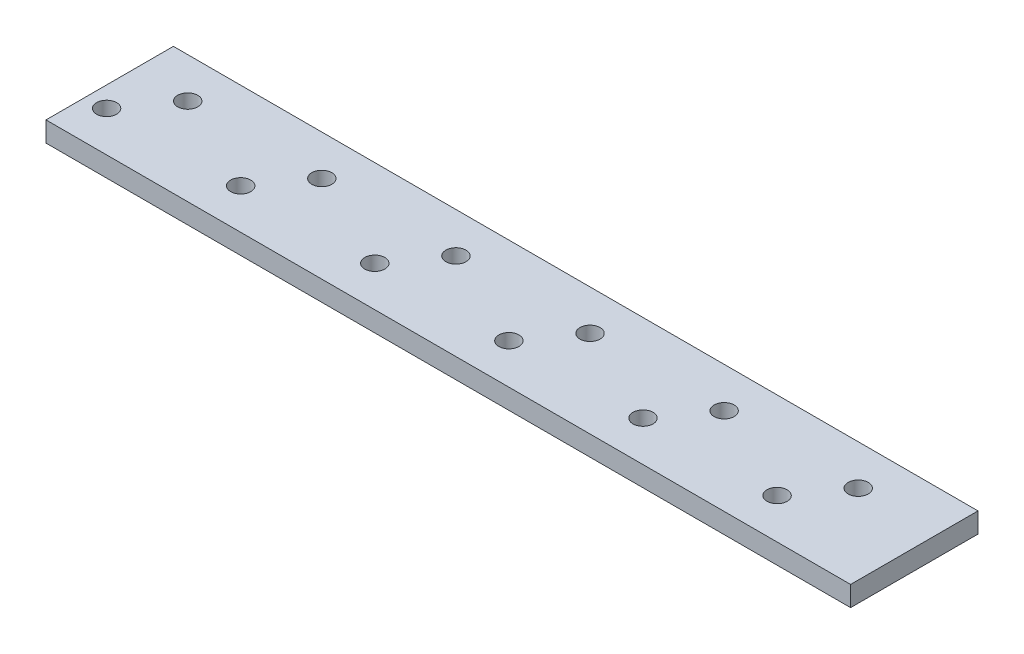
ISO-10303-21;
HEADER;
FILE_DESCRIPTION(('STEP AP214'),'2;1');
FILE_NAME('part.step','',(''),(''),'','','');
FILE_SCHEMA(('AUTOMOTIVE_DESIGN { 1 0 10303 214 1 1 1 1 }'));
ENDSEC;
DATA;
#1=APPLICATION_CONTEXT('core data for automotive mechanical design processes');
#2=APPLICATION_PROTOCOL_DEFINITION('international standard','automotive_design',2000,#1);
#3=PRODUCT_CONTEXT('',#1,'mechanical');
#4=PRODUCT('Part','Part','',(#3));
#5=PRODUCT_RELATED_PRODUCT_CATEGORY('part','',(#4));
#6=PRODUCT_DEFINITION_FORMATION('','',#4);
#7=PRODUCT_DEFINITION_CONTEXT('part definition',#1,'design');
#8=PRODUCT_DEFINITION('design','',#6,#7);
#9=PRODUCT_DEFINITION_SHAPE('','',#8);
#10=(LENGTH_UNIT() NAMED_UNIT(*) SI_UNIT(.MILLI.,.METRE.));
#11=(NAMED_UNIT(*) PLANE_ANGLE_UNIT() SI_UNIT($,.RADIAN.));
#12=(NAMED_UNIT(*) SI_UNIT($,.STERADIAN.) SOLID_ANGLE_UNIT());
#13=UNCERTAINTY_MEASURE_WITH_UNIT(LENGTH_MEASURE(1.E-05),#10,'distance_accuracy_value','');
#14=(GEOMETRIC_REPRESENTATION_CONTEXT(3) GLOBAL_UNCERTAINTY_ASSIGNED_CONTEXT((#13)) GLOBAL_UNIT_ASSIGNED_CONTEXT((#10,
#11,#12)) REPRESENTATION_CONTEXT('',''));
#15=CARTESIAN_POINT('',(0.,0.,0.));
#16=DIRECTION('',(0.,0.,1.));
#17=DIRECTION('',(1.,0.,0.));
#18=AXIS2_PLACEMENT_3D('',#15,#16,#17);
#19=CARTESIAN_POINT('',(60.,3.,9.49999999999999));
#20=DIRECTION('',(-1.,0.,0.));
#21=DIRECTION('',(0.,0.,1.));
#22=AXIS2_PLACEMENT_3D('',#19,#20,#21);
#23=PLANE('',#22);
#24=DIRECTION('',(0.,0.,-1.));
#25=VECTOR('',#24,1.);
#26=CARTESIAN_POINT('',(60.,0.,9.49999999999999));
#27=LINE('',#26,#25);
#28=CARTESIAN_POINT('',(60.,0.,9.49999999999999));
#29=VERTEX_POINT('',#28);
#30=CARTESIAN_POINT('',(60.,0.,-9.49999999999999));
#31=VERTEX_POINT('',#30);
#32=EDGE_CURVE('E106',#29,#31,#27,.T.);
#33=ORIENTED_EDGE('',*,*,#32,.T.);
#34=DIRECTION('',(0.,-1.,0.));
#35=VECTOR('',#34,1.);
#36=CARTESIAN_POINT('',(60.,3.,-9.49999999999999));
#37=LINE('',#36,#35);
#38=CARTESIAN_POINT('',(60.,3.,-9.49999999999999));
#39=VERTEX_POINT('',#38);
#40=EDGE_CURVE('E11',#39,#31,#37,.T.);
#41=ORIENTED_EDGE('',*,*,#40,.F.);
#42=DIRECTION('',(0.,0.,-1.));
#43=VECTOR('',#42,1.);
#44=CARTESIAN_POINT('',(60.,3.,9.49999999999999));
#45=LINE('',#44,#43);
#46=CARTESIAN_POINT('',(60.,3.,9.49999999999999));
#47=VERTEX_POINT('',#46);
#48=EDGE_CURVE('E90',#47,#39,#45,.T.);
#49=ORIENTED_EDGE('',*,*,#48,.F.);
#50=DIRECTION('',(0.,-1.,0.));
#51=VECTOR('',#50,1.);
#52=CARTESIAN_POINT('',(60.,3.,9.49999999999999));
#53=LINE('',#52,#51);
#54=EDGE_CURVE('E102',#47,#29,#53,.T.);
#55=ORIENTED_EDGE('',*,*,#54,.T.);
#56=EDGE_LOOP('',(#33,#41,#49,#55));
#57=FACE_BOUND('',#56,.T.);
#58=ADVANCED_FACE('F38',(#57),#23,.F.);
#59=CARTESIAN_POINT('',(-60.,3.,-9.49999999999997));
#60=DIRECTION('',(0.,0.,1.));
#61=DIRECTION('',(1.,0.,0.));
#62=AXIS2_PLACEMENT_3D('',#59,#60,#61);
#63=PLANE('',#62);
#64=DIRECTION('',(-1.,0.,0.));
#65=VECTOR('',#64,1.);
#66=CARTESIAN_POINT('',(-60.,0.,-9.49999999999997));
#67=LINE('',#66,#65);
#68=CARTESIAN_POINT('',(-60.,0.,-9.49999999999997));
#69=VERTEX_POINT('',#68);
#70=EDGE_CURVE('E95',#31,#69,#67,.T.);
#71=ORIENTED_EDGE('',*,*,#70,.T.);
#72=DIRECTION('',(0.,-1.,0.));
#73=VECTOR('',#72,1.);
#74=CARTESIAN_POINT('',(-60.,3.,-9.49999999999997));
#75=LINE('',#74,#73);
#76=CARTESIAN_POINT('',(-60.,3.,-9.49999999999997));
#77=VERTEX_POINT('',#76);
#78=EDGE_CURVE('E47',#77,#69,#75,.T.);
#79=ORIENTED_EDGE('',*,*,#78,.F.);
#80=DIRECTION('',(-1.,0.,0.));
#81=VECTOR('',#80,1.);
#82=CARTESIAN_POINT('',(-60.,3.,-9.49999999999997));
#83=LINE('',#82,#81);
#84=EDGE_CURVE('E85',#39,#77,#83,.T.);
#85=ORIENTED_EDGE('',*,*,#84,.F.);
#86=ORIENTED_EDGE('',*,*,#40,.T.);
#87=EDGE_LOOP('',(#71,#79,#85,#86));
#88=FACE_BOUND('',#87,.T.);
#89=ADVANCED_FACE('F94',(#88),#63,.F.);
#90=CARTESIAN_POINT('',(-60.,3.,9.5));
#91=DIRECTION('',(1.,0.,0.));
#92=DIRECTION('',(0.,0.,-1.));
#93=AXIS2_PLACEMENT_3D('',#90,#91,#92);
#94=PLANE('',#93);
#95=DIRECTION('',(0.,0.,1.));
#96=VECTOR('',#95,1.);
#97=CARTESIAN_POINT('',(-60.,0.,9.5));
#98=LINE('',#97,#96);
#99=CARTESIAN_POINT('',(-60.,0.,9.5));
#100=VERTEX_POINT('',#99);
#101=EDGE_CURVE('E72',#69,#100,#98,.T.);
#102=ORIENTED_EDGE('',*,*,#101,.T.);
#103=DIRECTION('',(0.,-1.,0.));
#104=VECTOR('',#103,1.);
#105=CARTESIAN_POINT('',(-60.,3.,9.5));
#106=LINE('',#105,#104);
#107=CARTESIAN_POINT('',(-60.,3.,9.5));
#108=VERTEX_POINT('',#107);
#109=EDGE_CURVE('E97',#108,#100,#106,.T.);
#110=ORIENTED_EDGE('',*,*,#109,.F.);
#111=DIRECTION('',(0.,0.,1.));
#112=VECTOR('',#111,1.);
#113=CARTESIAN_POINT('',(-60.,3.,9.5));
#114=LINE('',#113,#112);
#115=EDGE_CURVE('E88',#77,#108,#114,.T.);
#116=ORIENTED_EDGE('',*,*,#115,.F.);
#117=ORIENTED_EDGE('',*,*,#78,.T.);
#118=EDGE_LOOP('',(#102,#110,#116,#117));
#119=FACE_BOUND('',#118,.T.);
#120=ADVANCED_FACE('F98',(#119),#94,.F.);
#121=CARTESIAN_POINT('',(-60.,3.,9.5));
#122=DIRECTION('',(0.,0.,-1.));
#123=DIRECTION('',(-1.,0.,0.));
#124=AXIS2_PLACEMENT_3D('',#121,#122,#123);
#125=PLANE('',#124);
#126=DIRECTION('',(1.,0.,0.));
#127=VECTOR('',#126,1.);
#128=CARTESIAN_POINT('',(-60.,0.,9.5));
#129=LINE('',#128,#127);
#130=EDGE_CURVE('E78',#100,#29,#129,.T.);
#131=ORIENTED_EDGE('',*,*,#130,.T.);
#132=ORIENTED_EDGE('',*,*,#54,.F.);
#133=DIRECTION('',(1.,0.,0.));
#134=VECTOR('',#133,1.);
#135=CARTESIAN_POINT('',(-60.,3.,9.5));
#136=LINE('',#135,#134);
#137=EDGE_CURVE('E55',#108,#47,#136,.T.);
#138=ORIENTED_EDGE('',*,*,#137,.F.);
#139=ORIENTED_EDGE('',*,*,#109,.T.);
#140=EDGE_LOOP('',(#131,#132,#138,#139));
#141=FACE_BOUND('',#140,.T.);
#142=ADVANCED_FACE('F120',(#141),#125,.F.);
#143=CARTESIAN_POINT('',(0.,3.,0.));
#144=DIRECTION('',(0.,-1.,0.));
#145=DIRECTION('',(0.,0.,-1.));
#146=AXIS2_PLACEMENT_3D('',#143,#144,#145);
#147=PLANE('',#146);
#148=CARTESIAN_POINT('',(-16.9636687374761,3.,3.5));
#149=DIRECTION('',(0.,1.,0.));
#150=DIRECTION('',(0.,0.,1.));
#151=AXIS2_PLACEMENT_3D('',#148,#149,#150);
#152=CIRCLE('',#151,1.5);
#153=CARTESIAN_POINT('',(-16.9636687374761,3.,5.));
#154=VERTEX_POINT('',#153);
#155=EDGE_CURVE('E176',#154,#154,#152,.T.);
#156=ORIENTED_EDGE('',*,*,#155,.F.);
#157=EDGE_LOOP('',(#156));
#158=FACE_BOUND('',#157,.T.);
#159=CARTESIAN_POINT('',(8.13755532856655,3.,-3.49999999999999));
#160=DIRECTION('',(0.,1.,0.));
#161=DIRECTION('',(0.,0.,1.));
#162=AXIS2_PLACEMENT_3D('',#159,#160,#161);
#163=CIRCLE('',#162,1.5);
#164=CARTESIAN_POINT('',(8.13755532856655,3.,-1.99999999999998));
#165=VERTEX_POINT('',#164);
#166=EDGE_CURVE('E167',#165,#165,#163,.T.);
#167=ORIENTED_EDGE('',*,*,#166,.F.);
#168=EDGE_LOOP('',(#167));
#169=FACE_BOUND('',#168,.T.);
#170=CARTESIAN_POINT('',(3.03633126252392,3.,3.5));
#171=DIRECTION('',(0.,1.,0.));
#172=DIRECTION('',(0.,0.,1.));
#173=AXIS2_PLACEMENT_3D('',#170,#171,#172);
#174=CIRCLE('',#173,1.5);
#175=CARTESIAN_POINT('',(3.03633126252392,3.,5.));
#176=VERTEX_POINT('',#175);
#177=EDGE_CURVE('E192',#176,#176,#174,.T.);
#178=ORIENTED_EDGE('',*,*,#177,.F.);
#179=EDGE_LOOP('',(#178));
#180=FACE_BOUND('',#179,.T.);
#181=CARTESIAN_POINT('',(28.1375553285666,3.,-3.49999999999999));
#182=DIRECTION('',(0.,1.,0.));
#183=DIRECTION('',(0.,0.,1.));
#184=AXIS2_PLACEMENT_3D('',#181,#182,#183);
#185=CIRCLE('',#184,1.5);
#186=CARTESIAN_POINT('',(28.1375553285666,3.,-1.99999999999998));
#187=VERTEX_POINT('',#186);
#188=EDGE_CURVE('E183',#187,#187,#185,.T.);
#189=ORIENTED_EDGE('',*,*,#188,.F.);
#190=EDGE_LOOP('',(#189));
#191=FACE_BOUND('',#190,.T.);
#192=CARTESIAN_POINT('',(-56.9636687374761,3.,3.5));
#193=DIRECTION('',(0.,1.,0.));
#194=DIRECTION('',(0.,0.,1.));
#195=AXIS2_PLACEMENT_3D('',#192,#193,#194);
#196=CIRCLE('',#195,1.5);
#197=CARTESIAN_POINT('',(-56.9636687374761,3.,5.));
#198=VERTEX_POINT('',#197);
#199=EDGE_CURVE('E144',#198,#198,#196,.T.);
#200=ORIENTED_EDGE('',*,*,#199,.F.);
#201=EDGE_LOOP('',(#200));
#202=FACE_BOUND('',#201,.T.);
#203=CARTESIAN_POINT('',(-31.8624446714334,3.,-3.49999999999999));
#204=DIRECTION('',(0.,1.,0.));
#205=DIRECTION('',(0.,0.,1.));
#206=AXIS2_PLACEMENT_3D('',#203,#204,#205);
#207=CIRCLE('',#206,1.5);
#208=CARTESIAN_POINT('',(-31.8624446714334,3.,-1.99999999999999));
#209=VERTEX_POINT('',#208);
#210=EDGE_CURVE('E135',#209,#209,#207,.T.);
#211=ORIENTED_EDGE('',*,*,#210,.F.);
#212=EDGE_LOOP('',(#211));
#213=FACE_BOUND('',#212,.T.);
#214=CARTESIAN_POINT('',(-36.9636687374761,3.,3.5));
#215=DIRECTION('',(0.,1.,0.));
#216=DIRECTION('',(0.,0.,1.));
#217=AXIS2_PLACEMENT_3D('',#214,#215,#216);
#218=CIRCLE('',#217,1.5);
#219=CARTESIAN_POINT('',(-36.9636687374761,3.,5.));
#220=VERTEX_POINT('',#219);
#221=EDGE_CURVE('E160',#220,#220,#218,.T.);
#222=ORIENTED_EDGE('',*,*,#221,.F.);
#223=EDGE_LOOP('',(#222));
#224=FACE_BOUND('',#223,.T.);
#225=CARTESIAN_POINT('',(-11.8624446714334,3.,-3.49999999999999));
#226=DIRECTION('',(0.,1.,0.));
#227=DIRECTION('',(0.,0.,1.));
#228=AXIS2_PLACEMENT_3D('',#225,#226,#227);
#229=CIRCLE('',#228,1.5);
#230=CARTESIAN_POINT('',(-11.8624446714334,3.,-1.99999999999998));
#231=VERTEX_POINT('',#230);
#232=EDGE_CURVE('E151',#231,#231,#229,.T.);
#233=ORIENTED_EDGE('',*,*,#232,.F.);
#234=EDGE_LOOP('',(#233));
#235=FACE_BOUND('',#234,.T.);
#236=CARTESIAN_POINT('',(43.0363312625239,3.,3.5));
#237=DIRECTION('',(0.,1.,0.));
#238=DIRECTION('',(0.,0.,1.));
#239=AXIS2_PLACEMENT_3D('',#236,#237,#238);
#240=CIRCLE('',#239,1.5);
#241=CARTESIAN_POINT('',(43.0363312625239,3.,5.));
#242=VERTEX_POINT('',#241);
#243=EDGE_CURVE('E215',#242,#242,#240,.T.);
#244=ORIENTED_EDGE('',*,*,#243,.F.);
#245=EDGE_LOOP('',(#244));
#246=FACE_BOUND('',#245,.T.);
#247=CARTESIAN_POINT('',(48.1375553285666,3.,-3.49999999999999));
#248=DIRECTION('',(0.,1.,0.));
#249=DIRECTION('',(0.,0.,1.));
#250=AXIS2_PLACEMENT_3D('',#247,#248,#249);
#251=CIRCLE('',#250,1.5);
#252=CARTESIAN_POINT('',(48.1375553285666,3.,-1.99999999999998));
#253=VERTEX_POINT('',#252);
#254=EDGE_CURVE('E199',#253,#253,#251,.T.);
#255=ORIENTED_EDGE('',*,*,#254,.F.);
#256=EDGE_LOOP('',(#255));
#257=FACE_BOUND('',#256,.T.);
#258=CARTESIAN_POINT('',(23.0363312625239,3.,3.5));
#259=DIRECTION('',(0.,1.,0.));
#260=DIRECTION('',(0.,0.,1.));
#261=AXIS2_PLACEMENT_3D('',#258,#259,#260);
#262=CIRCLE('',#261,1.5);
#263=CARTESIAN_POINT('',(23.0363312625239,3.,5.));
#264=VERTEX_POINT('',#263);
#265=EDGE_CURVE('E208',#264,#264,#262,.T.);
#266=ORIENTED_EDGE('',*,*,#265,.F.);
#267=EDGE_LOOP('',(#266));
#268=FACE_BOUND('',#267,.T.);
#269=CARTESIAN_POINT('',(-51.8624446714334,3.,-3.49999999999999));
#270=DIRECTION('',(0.,1.,0.));
#271=DIRECTION('',(0.,0.,1.));
#272=AXIS2_PLACEMENT_3D('',#269,#270,#271);
#273=CIRCLE('',#272,1.5);
#274=CARTESIAN_POINT('',(-51.8624446714334,3.,-1.99999999999998));
#275=VERTEX_POINT('',#274);
#276=EDGE_CURVE('E127',#275,#275,#273,.T.);
#277=ORIENTED_EDGE('',*,*,#276,.F.);
#278=EDGE_LOOP('',(#277));
#279=FACE_BOUND('',#278,.T.);
#280=ORIENTED_EDGE('',*,*,#48,.T.);
#281=ORIENTED_EDGE('',*,*,#84,.T.);
#282=ORIENTED_EDGE('',*,*,#115,.T.);
#283=ORIENTED_EDGE('',*,*,#137,.T.);
#284=EDGE_LOOP('',(#280,#281,#282,#283));
#285=FACE_BOUND('',#284,.T.);
#286=ADVANCED_FACE('F86',(#158,#169,#180,#191,#202,#213,#224,#235,#246,#257,#268,#279,#285),
#147,.F.);
#287=CARTESIAN_POINT('',(0.,0.,0.));
#288=DIRECTION('',(0.,-1.,0.));
#289=DIRECTION('',(0.,0.,-1.));
#290=AXIS2_PLACEMENT_3D('',#287,#288,#289);
#291=PLANE('',#290);
#292=CARTESIAN_POINT('',(-16.9636687374761,0.,3.5));
#293=DIRECTION('',(0.,1.,0.));
#294=DIRECTION('',(0.,0.,1.));
#295=AXIS2_PLACEMENT_3D('',#292,#293,#294);
#296=CIRCLE('',#295,1.5);
#297=CARTESIAN_POINT('',(-16.9636687374761,0.,5.));
#298=VERTEX_POINT('',#297);
#299=EDGE_CURVE('E156',#298,#298,#296,.T.);
#300=ORIENTED_EDGE('',*,*,#299,.T.);
#301=EDGE_LOOP('',(#300));
#302=FACE_BOUND('',#301,.T.);
#303=CARTESIAN_POINT('',(8.13755532856655,0.,-3.49999999999999));
#304=DIRECTION('',(0.,1.,0.));
#305=DIRECTION('',(0.,0.,1.));
#306=AXIS2_PLACEMENT_3D('',#303,#304,#305);
#307=CIRCLE('',#306,1.5);
#308=CARTESIAN_POINT('',(8.13755532856655,0.,-1.99999999999998));
#309=VERTEX_POINT('',#308);
#310=EDGE_CURVE('E171',#309,#309,#307,.T.);
#311=ORIENTED_EDGE('',*,*,#310,.T.);
#312=EDGE_LOOP('',(#311));
#313=FACE_BOUND('',#312,.T.);
#314=CARTESIAN_POINT('',(3.03633126252392,0.,3.5));
#315=DIRECTION('',(0.,1.,0.));
#316=DIRECTION('',(0.,0.,1.));
#317=AXIS2_PLACEMENT_3D('',#314,#315,#316);
#318=CIRCLE('',#317,1.5);
#319=CARTESIAN_POINT('',(3.03633126252392,0.,5.));
#320=VERTEX_POINT('',#319);
#321=EDGE_CURVE('E172',#320,#320,#318,.T.);
#322=ORIENTED_EDGE('',*,*,#321,.T.);
#323=EDGE_LOOP('',(#322));
#324=FACE_BOUND('',#323,.T.);
#325=CARTESIAN_POINT('',(28.1375553285666,0.,-3.49999999999999));
#326=DIRECTION('',(0.,1.,0.));
#327=DIRECTION('',(0.,0.,1.));
#328=AXIS2_PLACEMENT_3D('',#325,#326,#327);
#329=CIRCLE('',#328,1.5);
#330=CARTESIAN_POINT('',(28.1375553285666,0.,-1.99999999999998));
#331=VERTEX_POINT('',#330);
#332=EDGE_CURVE('E187',#331,#331,#329,.T.);
#333=ORIENTED_EDGE('',*,*,#332,.T.);
#334=EDGE_LOOP('',(#333));
#335=FACE_BOUND('',#334,.T.);
#336=CARTESIAN_POINT('',(-56.9636687374761,0.,3.5));
#337=DIRECTION('',(0.,1.,0.));
#338=DIRECTION('',(0.,0.,1.));
#339=AXIS2_PLACEMENT_3D('',#336,#337,#338);
#340=CIRCLE('',#339,1.5);
#341=CARTESIAN_POINT('',(-56.9636687374761,0.,5.));
#342=VERTEX_POINT('',#341);
#343=EDGE_CURVE('E131',#342,#342,#340,.T.);
#344=ORIENTED_EDGE('',*,*,#343,.T.);
#345=EDGE_LOOP('',(#344));
#346=FACE_BOUND('',#345,.T.);
#347=CARTESIAN_POINT('',(-31.8624446714334,0.,-3.49999999999999));
#348=DIRECTION('',(0.,1.,0.));
#349=DIRECTION('',(0.,0.,1.));
#350=AXIS2_PLACEMENT_3D('',#347,#348,#349);
#351=CIRCLE('',#350,1.5);
#352=CARTESIAN_POINT('',(-31.8624446714334,0.,-1.99999999999999));
#353=VERTEX_POINT('',#352);
#354=EDGE_CURVE('E139',#353,#353,#351,.T.);
#355=ORIENTED_EDGE('',*,*,#354,.T.);
#356=EDGE_LOOP('',(#355));
#357=FACE_BOUND('',#356,.T.);
#358=CARTESIAN_POINT('',(-36.9636687374761,0.,3.5));
#359=DIRECTION('',(0.,1.,0.));
#360=DIRECTION('',(0.,0.,1.));
#361=AXIS2_PLACEMENT_3D('',#358,#359,#360);
#362=CIRCLE('',#361,1.5);
#363=CARTESIAN_POINT('',(-36.9636687374761,0.,5.));
#364=VERTEX_POINT('',#363);
#365=EDGE_CURVE('E140',#364,#364,#362,.T.);
#366=ORIENTED_EDGE('',*,*,#365,.T.);
#367=EDGE_LOOP('',(#366));
#368=FACE_BOUND('',#367,.T.);
#369=CARTESIAN_POINT('',(-11.8624446714334,0.,-3.49999999999999));
#370=DIRECTION('',(0.,1.,0.));
#371=DIRECTION('',(0.,0.,1.));
#372=AXIS2_PLACEMENT_3D('',#369,#370,#371);
#373=CIRCLE('',#372,1.5);
#374=CARTESIAN_POINT('',(-11.8624446714334,0.,-1.99999999999998));
#375=VERTEX_POINT('',#374);
#376=EDGE_CURVE('E155',#375,#375,#373,.T.);
#377=ORIENTED_EDGE('',*,*,#376,.T.);
#378=EDGE_LOOP('',(#377));
#379=FACE_BOUND('',#378,.T.);
#380=CARTESIAN_POINT('',(43.0363312625239,0.,3.5));
#381=DIRECTION('',(0.,1.,0.));
#382=DIRECTION('',(0.,0.,1.));
#383=AXIS2_PLACEMENT_3D('',#380,#381,#382);
#384=CIRCLE('',#383,1.5);
#385=CARTESIAN_POINT('',(43.0363312625239,0.,5.));
#386=VERTEX_POINT('',#385);
#387=EDGE_CURVE('E204',#386,#386,#384,.T.);
#388=ORIENTED_EDGE('',*,*,#387,.T.);
#389=EDGE_LOOP('',(#388));
#390=FACE_BOUND('',#389,.T.);
#391=CARTESIAN_POINT('',(48.1375553285666,0.,-3.49999999999999));
#392=DIRECTION('',(0.,1.,0.));
#393=DIRECTION('',(0.,0.,1.));
#394=AXIS2_PLACEMENT_3D('',#391,#392,#393);
#395=CIRCLE('',#394,1.5);
#396=CARTESIAN_POINT('',(48.1375553285666,0.,-1.99999999999998));
#397=VERTEX_POINT('',#396);
#398=EDGE_CURVE('E203',#397,#397,#395,.T.);
#399=ORIENTED_EDGE('',*,*,#398,.T.);
#400=EDGE_LOOP('',(#399));
#401=FACE_BOUND('',#400,.T.);
#402=CARTESIAN_POINT('',(23.0363312625239,0.,3.5));
#403=DIRECTION('',(0.,1.,0.));
#404=DIRECTION('',(0.,0.,1.));
#405=AXIS2_PLACEMENT_3D('',#402,#403,#404);
#406=CIRCLE('',#405,1.5);
#407=CARTESIAN_POINT('',(23.0363312625239,0.,5.));
#408=VERTEX_POINT('',#407);
#409=EDGE_CURVE('E188',#408,#408,#406,.T.);
#410=ORIENTED_EDGE('',*,*,#409,.T.);
#411=EDGE_LOOP('',(#410));
#412=FACE_BOUND('',#411,.T.);
#413=CARTESIAN_POINT('',(-51.8624446714334,0.,-3.49999999999999));
#414=DIRECTION('',(0.,1.,0.));
#415=DIRECTION('',(0.,0.,1.));
#416=AXIS2_PLACEMENT_3D('',#413,#414,#415);
#417=CIRCLE('',#416,1.5);
#418=CARTESIAN_POINT('',(-51.8624446714334,0.,-1.99999999999998));
#419=VERTEX_POINT('',#418);
#420=EDGE_CURVE('E110',#419,#419,#417,.T.);
#421=ORIENTED_EDGE('',*,*,#420,.T.);
#422=EDGE_LOOP('',(#421));
#423=FACE_BOUND('',#422,.T.);
#424=ORIENTED_EDGE('',*,*,#32,.F.);
#425=ORIENTED_EDGE('',*,*,#130,.F.);
#426=ORIENTED_EDGE('',*,*,#101,.F.);
#427=ORIENTED_EDGE('',*,*,#70,.F.);
#428=EDGE_LOOP('',(#424,#425,#426,#427));
#429=FACE_BOUND('',#428,.T.);
#430=ADVANCED_FACE('F123',(#302,#313,#324,#335,#346,#357,#368,#379,#390,#401,#412,#423,#429),
#291,.T.);
#431=CARTESIAN_POINT('',(-51.8624446714334,0.,-3.49999999999999));
#432=DIRECTION('',(0.,1.,0.));
#433=DIRECTION('',(0.,0.,1.));
#434=AXIS2_PLACEMENT_3D('',#431,#432,#433);
#435=CYLINDRICAL_SURFACE('',#434,1.5);
#436=ORIENTED_EDGE('',*,*,#420,.F.);
#437=EDGE_LOOP('',(#436));
#438=FACE_BOUND('',#437,.T.);
#439=ORIENTED_EDGE('',*,*,#276,.T.);
#440=EDGE_LOOP('',(#439));
#441=FACE_BOUND('',#440,.T.);
#442=ADVANCED_FACE('F243',(#438,#441),#435,.F.);
#443=CARTESIAN_POINT('',(23.0363312625239,0.,3.5));
#444=DIRECTION('',(0.,1.,0.));
#445=DIRECTION('',(0.,0.,1.));
#446=AXIS2_PLACEMENT_3D('',#443,#444,#445);
#447=CYLINDRICAL_SURFACE('',#446,1.5);
#448=ORIENTED_EDGE('',*,*,#409,.F.);
#449=EDGE_LOOP('',(#448));
#450=FACE_BOUND('',#449,.T.);
#451=ORIENTED_EDGE('',*,*,#265,.T.);
#452=EDGE_LOOP('',(#451));
#453=FACE_BOUND('',#452,.T.);
#454=ADVANCED_FACE('F245',(#450,#453),#447,.F.);
#455=CARTESIAN_POINT('',(48.1375553285666,0.,-3.49999999999999));
#456=DIRECTION('',(0.,1.,0.));
#457=DIRECTION('',(0.,0.,1.));
#458=AXIS2_PLACEMENT_3D('',#455,#456,#457);
#459=CYLINDRICAL_SURFACE('',#458,1.5);
#460=ORIENTED_EDGE('',*,*,#398,.F.);
#461=EDGE_LOOP('',(#460));
#462=FACE_BOUND('',#461,.T.);
#463=ORIENTED_EDGE('',*,*,#254,.T.);
#464=EDGE_LOOP('',(#463));
#465=FACE_BOUND('',#464,.T.);
#466=ADVANCED_FACE('F229',(#462,#465),#459,.F.);
#467=CARTESIAN_POINT('',(43.0363312625239,0.,3.5));
#468=DIRECTION('',(0.,1.,0.));
#469=DIRECTION('',(0.,0.,1.));
#470=AXIS2_PLACEMENT_3D('',#467,#468,#469);
#471=CYLINDRICAL_SURFACE('',#470,1.5);
#472=ORIENTED_EDGE('',*,*,#387,.F.);
#473=EDGE_LOOP('',(#472));
#474=FACE_BOUND('',#473,.T.);
#475=ORIENTED_EDGE('',*,*,#243,.T.);
#476=EDGE_LOOP('',(#475));
#477=FACE_BOUND('',#476,.T.);
#478=ADVANCED_FACE('F225',(#474,#477),#471,.F.);
#479=CARTESIAN_POINT('',(-11.8624446714334,0.,-3.49999999999999));
#480=DIRECTION('',(0.,1.,0.));
#481=DIRECTION('',(0.,0.,1.));
#482=AXIS2_PLACEMENT_3D('',#479,#480,#481);
#483=CYLINDRICAL_SURFACE('',#482,1.5);
#484=ORIENTED_EDGE('',*,*,#376,.F.);
#485=EDGE_LOOP('',(#484));
#486=FACE_BOUND('',#485,.T.);
#487=ORIENTED_EDGE('',*,*,#232,.T.);
#488=EDGE_LOOP('',(#487));
#489=FACE_BOUND('',#488,.T.);
#490=ADVANCED_FACE('F228',(#486,#489),#483,.F.);
#491=CARTESIAN_POINT('',(-36.9636687374761,0.,3.5));
#492=DIRECTION('',(0.,1.,0.));
#493=DIRECTION('',(0.,0.,1.));
#494=AXIS2_PLACEMENT_3D('',#491,#492,#493);
#495=CYLINDRICAL_SURFACE('',#494,1.5);
#496=ORIENTED_EDGE('',*,*,#365,.F.);
#497=EDGE_LOOP('',(#496));
#498=FACE_BOUND('',#497,.T.);
#499=ORIENTED_EDGE('',*,*,#221,.T.);
#500=EDGE_LOOP('',(#499));
#501=FACE_BOUND('',#500,.T.);
#502=ADVANCED_FACE('F316',(#498,#501),#495,.F.);
#503=CARTESIAN_POINT('',(-31.8624446714334,0.,-3.49999999999999));
#504=DIRECTION('',(0.,1.,0.));
#505=DIRECTION('',(0.,0.,1.));
#506=AXIS2_PLACEMENT_3D('',#503,#504,#505);
#507=CYLINDRICAL_SURFACE('',#506,1.5);
#508=ORIENTED_EDGE('',*,*,#354,.F.);
#509=EDGE_LOOP('',(#508));
#510=FACE_BOUND('',#509,.T.);
#511=ORIENTED_EDGE('',*,*,#210,.T.);
#512=EDGE_LOOP('',(#511));
#513=FACE_BOUND('',#512,.T.);
#514=ADVANCED_FACE('F326',(#510,#513),#507,.F.);
#515=CARTESIAN_POINT('',(-56.9636687374761,0.,3.5));
#516=DIRECTION('',(0.,1.,0.));
#517=DIRECTION('',(0.,0.,1.));
#518=AXIS2_PLACEMENT_3D('',#515,#516,#517);
#519=CYLINDRICAL_SURFACE('',#518,1.5);
#520=ORIENTED_EDGE('',*,*,#343,.F.);
#521=EDGE_LOOP('',(#520));
#522=FACE_BOUND('',#521,.T.);
#523=ORIENTED_EDGE('',*,*,#199,.T.);
#524=EDGE_LOOP('',(#523));
#525=FACE_BOUND('',#524,.T.);
#526=ADVANCED_FACE('F336',(#522,#525),#519,.F.);
#527=CARTESIAN_POINT('',(28.1375553285666,0.,-3.49999999999999));
#528=DIRECTION('',(0.,1.,0.));
#529=DIRECTION('',(0.,0.,1.));
#530=AXIS2_PLACEMENT_3D('',#527,#528,#529);
#531=CYLINDRICAL_SURFACE('',#530,1.5);
#532=ORIENTED_EDGE('',*,*,#332,.F.);
#533=EDGE_LOOP('',(#532));
#534=FACE_BOUND('',#533,.T.);
#535=ORIENTED_EDGE('',*,*,#188,.T.);
#536=EDGE_LOOP('',(#535));
#537=FACE_BOUND('',#536,.T.);
#538=ADVANCED_FACE('F345',(#534,#537),#531,.F.);
#539=CARTESIAN_POINT('',(3.03633126252392,0.,3.5));
#540=DIRECTION('',(0.,1.,0.));
#541=DIRECTION('',(0.,0.,1.));
#542=AXIS2_PLACEMENT_3D('',#539,#540,#541);
#543=CYLINDRICAL_SURFACE('',#542,1.5);
#544=ORIENTED_EDGE('',*,*,#321,.F.);
#545=EDGE_LOOP('',(#544));
#546=FACE_BOUND('',#545,.T.);
#547=ORIENTED_EDGE('',*,*,#177,.T.);
#548=EDGE_LOOP('',(#547));
#549=FACE_BOUND('',#548,.T.);
#550=ADVANCED_FACE('F355',(#546,#549),#543,.F.);
#551=CARTESIAN_POINT('',(8.13755532856655,0.,-3.49999999999999));
#552=DIRECTION('',(0.,1.,0.));
#553=DIRECTION('',(0.,0.,1.));
#554=AXIS2_PLACEMENT_3D('',#551,#552,#553);
#555=CYLINDRICAL_SURFACE('',#554,1.5);
#556=ORIENTED_EDGE('',*,*,#310,.F.);
#557=EDGE_LOOP('',(#556));
#558=FACE_BOUND('',#557,.T.);
#559=ORIENTED_EDGE('',*,*,#166,.T.);
#560=EDGE_LOOP('',(#559));
#561=FACE_BOUND('',#560,.T.);
#562=ADVANCED_FACE('F365',(#558,#561),#555,.F.);
#563=CARTESIAN_POINT('',(-16.9636687374761,0.,3.5));
#564=DIRECTION('',(0.,1.,0.));
#565=DIRECTION('',(0.,0.,1.));
#566=AXIS2_PLACEMENT_3D('',#563,#564,#565);
#567=CYLINDRICAL_SURFACE('',#566,1.5);
#568=ORIENTED_EDGE('',*,*,#299,.F.);
#569=EDGE_LOOP('',(#568));
#570=FACE_BOUND('',#569,.T.);
#571=ORIENTED_EDGE('',*,*,#155,.T.);
#572=EDGE_LOOP('',(#571));
#573=FACE_BOUND('',#572,.T.);
#574=ADVANCED_FACE('F375',(#570,#573),#567,.F.);
#575=CLOSED_SHELL('',(#58,#89,#120,#142,#286,#430,#442,#454,#466,#478,#490,#502,#514,#526,#538,
#550,#562,#574));
#576=MANIFOLD_SOLID_BREP('B2',#575);
#577=ADVANCED_BREP_SHAPE_REPRESENTATION('',(#18,#576),#14);
#578=SHAPE_DEFINITION_REPRESENTATION(#9,#577);
ENDSEC;
END-ISO-10303-21;
